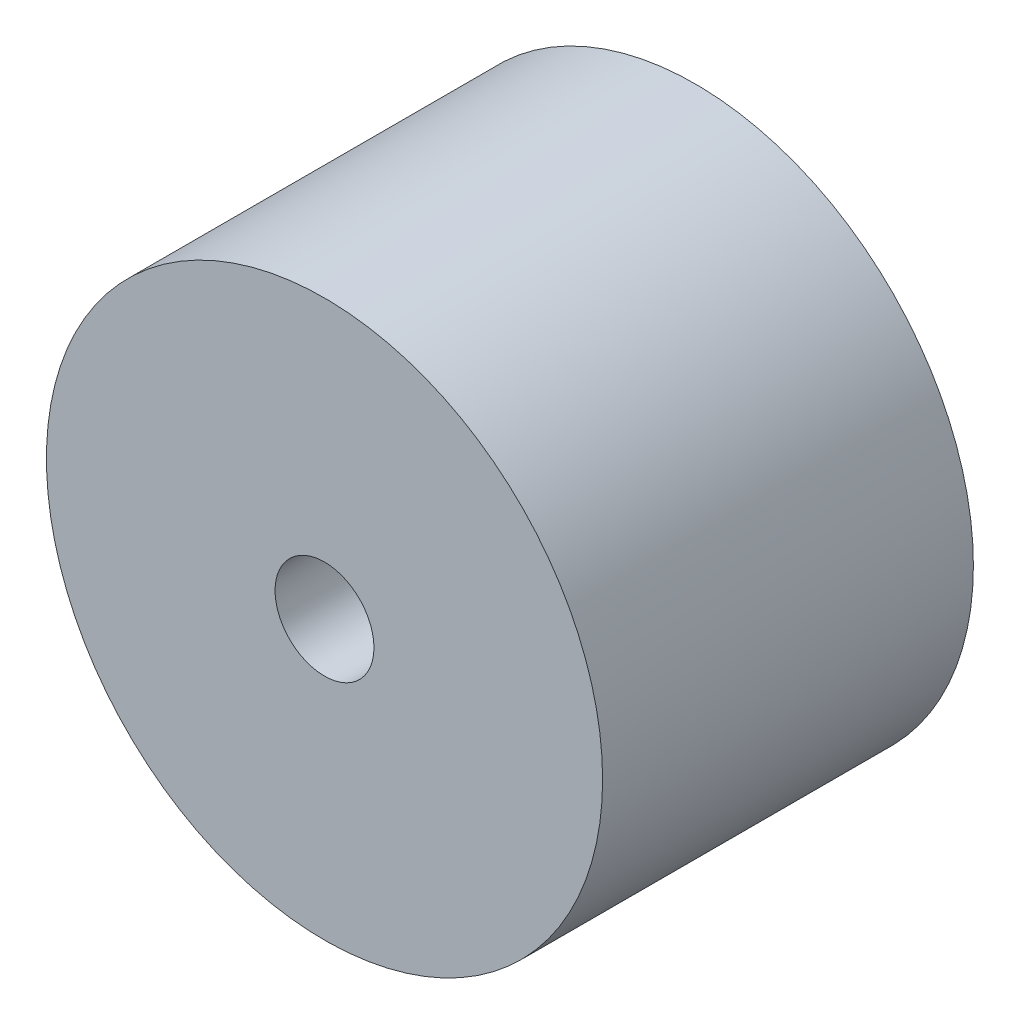
ISO-10303-21;
HEADER;
FILE_DESCRIPTION(('STEP AP214'),'2;1');
FILE_NAME('part.step','',(''),(''),'','','');
FILE_SCHEMA(('AUTOMOTIVE_DESIGN { 1 0 10303 214 1 1 1 1 }'));
ENDSEC;
DATA;
#1=APPLICATION_CONTEXT('core data for automotive mechanical design processes');
#2=APPLICATION_PROTOCOL_DEFINITION('international standard','automotive_design',2000,#1);
#3=PRODUCT_CONTEXT('',#1,'mechanical');
#4=PRODUCT('Part','Part','',(#3));
#5=PRODUCT_RELATED_PRODUCT_CATEGORY('part','',(#4));
#6=PRODUCT_DEFINITION_FORMATION('','',#4);
#7=PRODUCT_DEFINITION_CONTEXT('part definition',#1,'design');
#8=PRODUCT_DEFINITION('design','',#6,#7);
#9=PRODUCT_DEFINITION_SHAPE('','',#8);
#10=(LENGTH_UNIT() NAMED_UNIT(*) SI_UNIT(.MILLI.,.METRE.));
#11=(NAMED_UNIT(*) PLANE_ANGLE_UNIT() SI_UNIT($,.RADIAN.));
#12=(NAMED_UNIT(*) SI_UNIT($,.STERADIAN.) SOLID_ANGLE_UNIT());
#13=UNCERTAINTY_MEASURE_WITH_UNIT(LENGTH_MEASURE(1.E-05),#10,'distance_accuracy_value','');
#14=(GEOMETRIC_REPRESENTATION_CONTEXT(3) GLOBAL_UNCERTAINTY_ASSIGNED_CONTEXT((#13)) GLOBAL_UNIT_ASSIGNED_CONTEXT((#10,
#11,#12)) REPRESENTATION_CONTEXT('',''));
#15=CARTESIAN_POINT('',(0.,0.,0.));
#16=DIRECTION('',(0.,0.,1.));
#17=DIRECTION('',(1.,0.,0.));
#18=AXIS2_PLACEMENT_3D('',#15,#16,#17);
#19=CARTESIAN_POINT('',(0.,0.,3.));
#20=DIRECTION('',(0.,0.,1.));
#21=DIRECTION('',(1.,0.,0.));
#22=AXIS2_PLACEMENT_3D('',#19,#20,#21);
#23=PLANE('',#22);
#24=CARTESIAN_POINT('',(0.,0.,3.));
#25=DIRECTION('',(0.,0.,1.));
#26=DIRECTION('',(1.,0.,0.));
#27=AXIS2_PLACEMENT_3D('',#24,#25,#26);
#28=CIRCLE('',#27,2.25);
#29=CARTESIAN_POINT('',(2.25,0.,3.));
#30=VERTEX_POINT('',#29);
#31=EDGE_CURVE('E10',#30,#30,#28,.T.);
#32=ORIENTED_EDGE('',*,*,#31,.T.);
#33=EDGE_LOOP('',(#32));
#34=FACE_BOUND('',#33,.T.);
#35=CARTESIAN_POINT('',(0.,0.,3.));
#36=DIRECTION('',(0.,0.,1.));
#37=DIRECTION('',(1.,0.,0.));
#38=AXIS2_PLACEMENT_3D('',#35,#36,#37);
#39=CIRCLE('',#38,0.4);
#40=CARTESIAN_POINT('',(0.4,0.,3.));
#41=VERTEX_POINT('',#40);
#42=EDGE_CURVE('E42',#41,#41,#39,.T.);
#43=ORIENTED_EDGE('',*,*,#42,.F.);
#44=EDGE_LOOP('',(#43));
#45=FACE_BOUND('',#44,.T.);
#46=ADVANCED_FACE('F31',(#34,#45),#23,.T.);
#47=CARTESIAN_POINT('',(0.,0.,0.));
#48=DIRECTION('',(0.,0.,1.));
#49=DIRECTION('',(1.,0.,0.));
#50=AXIS2_PLACEMENT_3D('',#47,#48,#49);
#51=PLANE('',#50);
#52=CARTESIAN_POINT('',(0.,0.,0.));
#53=DIRECTION('',(0.,0.,1.));
#54=DIRECTION('',(1.,0.,0.));
#55=AXIS2_PLACEMENT_3D('',#52,#53,#54);
#56=CIRCLE('',#55,2.25);
#57=CARTESIAN_POINT('',(2.25,0.,0.));
#58=VERTEX_POINT('',#57);
#59=EDGE_CURVE('E35',#58,#58,#56,.T.);
#60=ORIENTED_EDGE('',*,*,#59,.F.);
#61=EDGE_LOOP('',(#60));
#62=FACE_BOUND('',#61,.T.);
#63=CARTESIAN_POINT('',(0.,0.,0.));
#64=DIRECTION('',(0.,0.,1.));
#65=DIRECTION('',(1.,0.,0.));
#66=AXIS2_PLACEMENT_3D('',#63,#64,#65);
#67=CIRCLE('',#66,0.4);
#68=CARTESIAN_POINT('',(0.4,0.,0.));
#69=VERTEX_POINT('',#68);
#70=EDGE_CURVE('E44',#69,#69,#67,.T.);
#71=ORIENTED_EDGE('',*,*,#70,.T.);
#72=EDGE_LOOP('',(#71));
#73=FACE_BOUND('',#72,.T.);
#74=ADVANCED_FACE('F54',(#62,#73),#51,.F.);
#75=CARTESIAN_POINT('',(0.,0.,3.));
#76=DIRECTION('',(0.,0.,-1.));
#77=DIRECTION('',(-1.,0.,0.));
#78=AXIS2_PLACEMENT_3D('',#75,#76,#77);
#79=CYLINDRICAL_SURFACE('',#78,2.25);
#80=ORIENTED_EDGE('',*,*,#31,.F.);
#81=EDGE_LOOP('',(#80));
#82=FACE_BOUND('',#81,.T.);
#83=ORIENTED_EDGE('',*,*,#59,.T.);
#84=EDGE_LOOP('',(#83));
#85=FACE_BOUND('',#84,.T.);
#86=ADVANCED_FACE('F33',(#82,#85),#79,.T.);
#87=CARTESIAN_POINT('',(0.,0.,3.));
#88=DIRECTION('',(0.,0.,-1.));
#89=DIRECTION('',(-1.,0.,0.));
#90=AXIS2_PLACEMENT_3D('',#87,#88,#89);
#91=CYLINDRICAL_SURFACE('',#90,0.4);
#92=ORIENTED_EDGE('',*,*,#42,.T.);
#93=EDGE_LOOP('',(#92));
#94=FACE_BOUND('',#93,.T.);
#95=ORIENTED_EDGE('',*,*,#70,.F.);
#96=EDGE_LOOP('',(#95));
#97=FACE_BOUND('',#96,.T.);
#98=ADVANCED_FACE('F50',(#94,#97),#91,.F.);
#99=CLOSED_SHELL('',(#46,#74,#86,#98));
#100=MANIFOLD_SOLID_BREP('B2',#99);
#101=ADVANCED_BREP_SHAPE_REPRESENTATION('',(#18,#100),#14);
#102=SHAPE_DEFINITION_REPRESENTATION(#9,#101);
ENDSEC;
END-ISO-10303-21;
